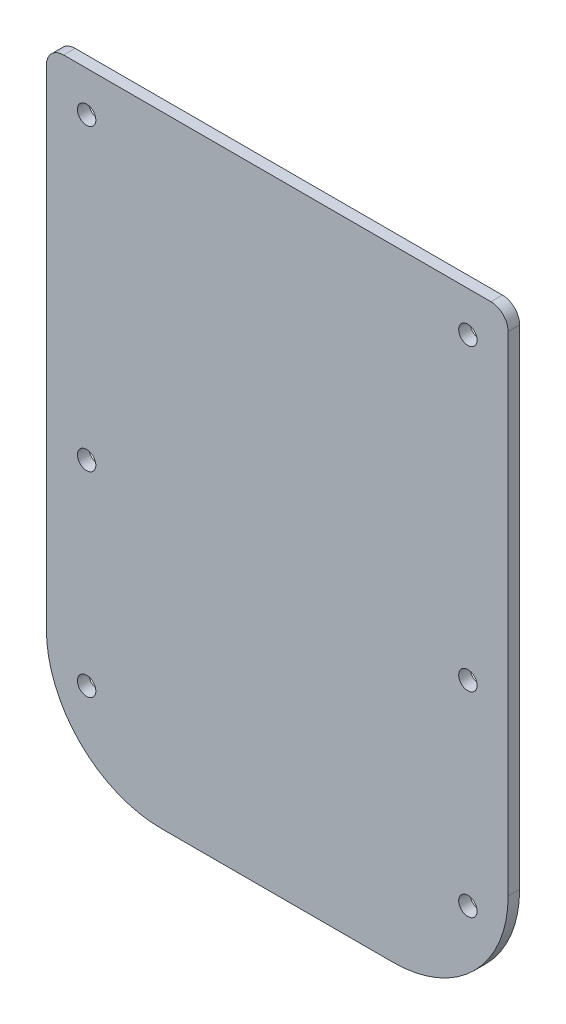
ISO-10303-21;
HEADER;
FILE_DESCRIPTION(('STEP AP214'),'2;1');
FILE_NAME('part.step','',(''),(''),'','','');
FILE_SCHEMA(('AUTOMOTIVE_DESIGN { 1 0 10303 214 1 1 1 1 }'));
ENDSEC;
DATA;
#1=APPLICATION_CONTEXT('core data for automotive mechanical design processes');
#2=APPLICATION_PROTOCOL_DEFINITION('international standard','automotive_design',2000,#1);
#3=PRODUCT_CONTEXT('',#1,'mechanical');
#4=PRODUCT('Part','Part','',(#3));
#5=PRODUCT_RELATED_PRODUCT_CATEGORY('part','',(#4));
#6=PRODUCT_DEFINITION_FORMATION('','',#4);
#7=PRODUCT_DEFINITION_CONTEXT('part definition',#1,'design');
#8=PRODUCT_DEFINITION('design','',#6,#7);
#9=PRODUCT_DEFINITION_SHAPE('','',#8);
#10=(LENGTH_UNIT() NAMED_UNIT(*) SI_UNIT(.MILLI.,.METRE.));
#11=(NAMED_UNIT(*) PLANE_ANGLE_UNIT() SI_UNIT($,.RADIAN.));
#12=(NAMED_UNIT(*) SI_UNIT($,.STERADIAN.) SOLID_ANGLE_UNIT());
#13=UNCERTAINTY_MEASURE_WITH_UNIT(LENGTH_MEASURE(1.E-05),#10,'distance_accuracy_value','');
#14=(GEOMETRIC_REPRESENTATION_CONTEXT(3) GLOBAL_UNCERTAINTY_ASSIGNED_CONTEXT((#13)) GLOBAL_UNIT_ASSIGNED_CONTEXT((#10,
#11,#12)) REPRESENTATION_CONTEXT('',''));
#15=CARTESIAN_POINT('',(0.,0.,0.));
#16=DIRECTION('',(0.,0.,1.));
#17=DIRECTION('',(1.,0.,0.));
#18=AXIS2_PLACEMENT_3D('',#15,#16,#17);
#19=CARTESIAN_POINT('',(0.,0.,2.));
#20=DIRECTION('',(1.,0.,0.));
#21=DIRECTION('',(0.,0.,-1.));
#22=AXIS2_PLACEMENT_3D('',#19,#20,#21);
#23=PLANE('',#22);
#24=DIRECTION('',(0.,-1.,0.));
#25=VECTOR('',#24,1.);
#26=CARTESIAN_POINT('',(0.,0.,0.));
#27=LINE('',#26,#25);
#28=CARTESIAN_POINT('',(0.,63.,0.));
#29=VERTEX_POINT('',#28);
#30=CARTESIAN_POINT('',(0.,-22.,0.));
#31=VERTEX_POINT('',#30);
#32=EDGE_CURVE('E129',#29,#31,#27,.T.);
#33=ORIENTED_EDGE('',*,*,#32,.T.);
#34=DIRECTION('',(0.,0.,-1.));
#35=VECTOR('',#34,1.);
#36=CARTESIAN_POINT('',(0.,-22.,2.));
#37=LINE('',#36,#35);
#38=CARTESIAN_POINT('',(0.,-22.,2.));
#39=VERTEX_POINT('',#38);
#40=EDGE_CURVE('E55',#31,#39,#37,.F.);
#41=ORIENTED_EDGE('',*,*,#40,.T.);
#42=DIRECTION('',(0.,-1.,0.));
#43=VECTOR('',#42,1.);
#44=CARTESIAN_POINT('',(0.,0.,2.));
#45=LINE('',#44,#43);
#46=CARTESIAN_POINT('',(0.,63.,2.));
#47=VERTEX_POINT('',#46);
#48=EDGE_CURVE('E124',#47,#39,#45,.T.);
#49=ORIENTED_EDGE('',*,*,#48,.F.);
#50=DIRECTION('',(0.,0.,-1.));
#51=VECTOR('',#50,1.);
#52=CARTESIAN_POINT('',(0.,63.,2.));
#53=LINE('',#52,#51);
#54=EDGE_CURVE('E140',#47,#29,#53,.T.);
#55=ORIENTED_EDGE('',*,*,#54,.T.);
#56=EDGE_LOOP('',(#33,#41,#49,#55));
#57=FACE_BOUND('',#56,.T.);
#58=ADVANCED_FACE('F32',(#57),#23,.F.);
#59=CARTESIAN_POINT('',(80.3,0.,2.));
#60=DIRECTION('',(-1.,0.,0.));
#61=DIRECTION('',(0.,0.,1.));
#62=AXIS2_PLACEMENT_3D('',#59,#60,#61);
#63=PLANE('',#62);
#64=DIRECTION('',(0.,1.,0.));
#65=VECTOR('',#64,1.);
#66=CARTESIAN_POINT('',(80.3,0.,2.));
#67=LINE('',#66,#65);
#68=CARTESIAN_POINT('',(80.3,-22.,2.));
#69=VERTEX_POINT('',#68);
#70=CARTESIAN_POINT('',(80.3,63.,2.));
#71=VERTEX_POINT('',#70);
#72=EDGE_CURVE('E127',#69,#71,#67,.T.);
#73=ORIENTED_EDGE('',*,*,#72,.F.);
#74=DIRECTION('',(0.,0.,1.));
#75=VECTOR('',#74,1.);
#76=CARTESIAN_POINT('',(80.3,-22.,0.));
#77=LINE('',#76,#75);
#78=CARTESIAN_POINT('',(80.3,-22.,0.));
#79=VERTEX_POINT('',#78);
#80=EDGE_CURVE('E11',#69,#79,#77,.F.);
#81=ORIENTED_EDGE('',*,*,#80,.T.);
#82=DIRECTION('',(0.,1.,0.));
#83=VECTOR('',#82,1.);
#84=CARTESIAN_POINT('',(80.3,0.,0.));
#85=LINE('',#84,#83);
#86=CARTESIAN_POINT('',(80.3,63.,0.));
#87=VERTEX_POINT('',#86);
#88=EDGE_CURVE('E125',#79,#87,#85,.T.);
#89=ORIENTED_EDGE('',*,*,#88,.T.);
#90=DIRECTION('',(0.,0.,-1.));
#91=VECTOR('',#90,1.);
#92=CARTESIAN_POINT('',(80.3,63.,2.));
#93=LINE('',#92,#91);
#94=EDGE_CURVE('E105',#87,#71,#93,.F.);
#95=ORIENTED_EDGE('',*,*,#94,.T.);
#96=EDGE_LOOP('',(#73,#81,#89,#95));
#97=FACE_BOUND('',#96,.T.);
#98=ADVANCED_FACE('F240',(#97),#63,.F.);
#99=CARTESIAN_POINT('',(0.,66.,2.));
#100=DIRECTION('',(0.,-1.,0.));
#101=DIRECTION('',(0.,0.,-1.));
#102=AXIS2_PLACEMENT_3D('',#99,#100,#101);
#103=PLANE('',#102);
#104=DIRECTION('',(-1.,0.,0.));
#105=VECTOR('',#104,1.);
#106=CARTESIAN_POINT('',(0.,66.,2.));
#107=LINE('',#106,#105);
#108=CARTESIAN_POINT('',(77.3,66.,2.));
#109=VERTEX_POINT('',#108);
#110=CARTESIAN_POINT('',(3.,66.,2.));
#111=VERTEX_POINT('',#110);
#112=EDGE_CURVE('E118',#109,#111,#107,.T.);
#113=ORIENTED_EDGE('',*,*,#112,.F.);
#114=DIRECTION('',(0.,0.,-1.));
#115=VECTOR('',#114,1.);
#116=CARTESIAN_POINT('',(77.3,66.,2.));
#117=LINE('',#116,#115);
#118=CARTESIAN_POINT('',(77.3,66.,0.));
#119=VERTEX_POINT('',#118);
#120=EDGE_CURVE('E103',#109,#119,#117,.T.);
#121=ORIENTED_EDGE('',*,*,#120,.T.);
#122=DIRECTION('',(-1.,0.,0.));
#123=VECTOR('',#122,1.);
#124=CARTESIAN_POINT('',(0.,66.,0.));
#125=LINE('',#124,#123);
#126=CARTESIAN_POINT('',(3.,66.,0.));
#127=VERTEX_POINT('',#126);
#128=EDGE_CURVE('E115',#119,#127,#125,.T.);
#129=ORIENTED_EDGE('',*,*,#128,.T.);
#130=DIRECTION('',(0.,0.,-1.));
#131=VECTOR('',#130,1.);
#132=CARTESIAN_POINT('',(3.,66.,2.));
#133=LINE('',#132,#131);
#134=EDGE_CURVE('E119',#127,#111,#133,.F.);
#135=ORIENTED_EDGE('',*,*,#134,.T.);
#136=EDGE_LOOP('',(#113,#121,#129,#135));
#137=FACE_BOUND('',#136,.T.);
#138=ADVANCED_FACE('F114',(#137),#103,.F.);
#139=CARTESIAN_POINT('',(0.,0.,2.));
#140=DIRECTION('',(0.,0.,-1.));
#141=DIRECTION('',(-1.,0.,0.));
#142=AXIS2_PLACEMENT_3D('',#139,#140,#141);
#143=PLANE('',#142);
#144=CARTESIAN_POINT('',(7.,-27.,2.));
#145=DIRECTION('',(0.,0.,1.));
#146=DIRECTION('',(1.,0.,0.));
#147=AXIS2_PLACEMENT_3D('',#144,#145,#146);
#148=CIRCLE('',#147,1.59999999999999);
#149=CARTESIAN_POINT('',(8.59999999999999,-27.,2.));
#150=VERTEX_POINT('',#149);
#151=EDGE_CURVE('E205',#150,#150,#148,.T.);
#152=ORIENTED_EDGE('',*,*,#151,.F.);
#153=EDGE_LOOP('',(#152));
#154=FACE_BOUND('',#153,.T.);
#155=CARTESIAN_POINT('',(73.3,-27.,2.));
#156=DIRECTION('',(0.,0.,1.));
#157=DIRECTION('',(1.,0.,0.));
#158=AXIS2_PLACEMENT_3D('',#155,#156,#157);
#159=CIRCLE('',#158,1.59999999999999);
#160=CARTESIAN_POINT('',(74.9,-27.,2.));
#161=VERTEX_POINT('',#160);
#162=EDGE_CURVE('E199',#161,#161,#159,.T.);
#163=ORIENTED_EDGE('',*,*,#162,.F.);
#164=EDGE_LOOP('',(#163));
#165=FACE_BOUND('',#164,.T.);
#166=CARTESIAN_POINT('',(7.,59.,2.));
#167=DIRECTION('',(0.,0.,1.));
#168=DIRECTION('',(1.,0.,0.));
#169=AXIS2_PLACEMENT_3D('',#166,#167,#168);
#170=CIRCLE('',#169,1.59999999999999);
#171=CARTESIAN_POINT('',(8.59999999999999,59.,2.));
#172=VERTEX_POINT('',#171);
#173=EDGE_CURVE('E164',#172,#172,#170,.T.);
#174=ORIENTED_EDGE('',*,*,#173,.F.);
#175=EDGE_LOOP('',(#174));
#176=FACE_BOUND('',#175,.T.);
#177=CARTESIAN_POINT('',(73.3,59.,2.));
#178=DIRECTION('',(0.,0.,1.));
#179=DIRECTION('',(1.,0.,0.));
#180=AXIS2_PLACEMENT_3D('',#177,#178,#179);
#181=CIRCLE('',#180,1.59999999999999);
#182=CARTESIAN_POINT('',(74.9,59.,2.));
#183=VERTEX_POINT('',#182);
#184=EDGE_CURVE('E187',#183,#183,#181,.T.);
#185=ORIENTED_EDGE('',*,*,#184,.F.);
#186=EDGE_LOOP('',(#185));
#187=FACE_BOUND('',#186,.T.);
#188=CARTESIAN_POINT('',(73.3,7.,2.));
#189=DIRECTION('',(0.,0.,1.));
#190=DIRECTION('',(1.,0.,0.));
#191=AXIS2_PLACEMENT_3D('',#188,#189,#190);
#192=CIRCLE('',#191,1.59999999999999);
#193=CARTESIAN_POINT('',(74.9,7.,2.));
#194=VERTEX_POINT('',#193);
#195=EDGE_CURVE('E181',#194,#194,#192,.T.);
#196=ORIENTED_EDGE('',*,*,#195,.F.);
#197=EDGE_LOOP('',(#196));
#198=FACE_BOUND('',#197,.T.);
#199=CARTESIAN_POINT('',(7.00000000000001,7.,2.));
#200=DIRECTION('',(0.,0.,1.));
#201=DIRECTION('',(1.,0.,0.));
#202=AXIS2_PLACEMENT_3D('',#199,#200,#201);
#203=CIRCLE('',#202,1.59999999999999);
#204=CARTESIAN_POINT('',(8.59999999999999,7.,2.));
#205=VERTEX_POINT('',#204);
#206=EDGE_CURVE('E171',#205,#205,#203,.T.);
#207=ORIENTED_EDGE('',*,*,#206,.F.);
#208=EDGE_LOOP('',(#207));
#209=FACE_BOUND('',#208,.T.);
#210=ORIENTED_EDGE('',*,*,#48,.T.);
#211=CARTESIAN_POINT('',(20.,-22.,2.));
#212=DIRECTION('',(0.,0.,-1.));
#213=DIRECTION('',(-1.,0.,0.));
#214=AXIS2_PLACEMENT_3D('',#211,#212,#213);
#215=CIRCLE('',#214,20.);
#216=CARTESIAN_POINT('',(20.,-42.,2.));
#217=VERTEX_POINT('',#216);
#218=EDGE_CURVE('E40',#39,#217,#215,.F.);
#219=ORIENTED_EDGE('',*,*,#218,.T.);
#220=DIRECTION('',(-1.,0.,0.));
#221=VECTOR('',#220,1.);
#222=CARTESIAN_POINT('',(80.3,-42.,2.));
#223=LINE('',#222,#221);
#224=CARTESIAN_POINT('',(60.3,-42.,2.));
#225=VERTEX_POINT('',#224);
#226=EDGE_CURVE('E157',#225,#217,#223,.T.);
#227=ORIENTED_EDGE('',*,*,#226,.F.);
#228=CARTESIAN_POINT('',(60.3,-22.,2.));
#229=DIRECTION('',(0.,0.,-1.));
#230=DIRECTION('',(-1.,0.,0.));
#231=AXIS2_PLACEMENT_3D('',#228,#229,#230);
#232=CIRCLE('',#231,20.);
#233=EDGE_CURVE('E47',#225,#69,#232,.F.);
#234=ORIENTED_EDGE('',*,*,#233,.T.);
#235=ORIENTED_EDGE('',*,*,#72,.T.);
#236=CARTESIAN_POINT('',(77.3,63.,2.));
#237=DIRECTION('',(0.,0.,-1.));
#238=DIRECTION('',(-1.,0.,0.));
#239=AXIS2_PLACEMENT_3D('',#236,#237,#238);
#240=CIRCLE('',#239,3.);
#241=EDGE_CURVE('E138',#71,#109,#240,.F.);
#242=ORIENTED_EDGE('',*,*,#241,.T.);
#243=ORIENTED_EDGE('',*,*,#112,.T.);
#244=CARTESIAN_POINT('',(3.,63.,2.));
#245=DIRECTION('',(0.,0.,-1.));
#246=DIRECTION('',(-1.,0.,0.));
#247=AXIS2_PLACEMENT_3D('',#244,#245,#246);
#248=CIRCLE('',#247,3.);
#249=EDGE_CURVE('E136',#111,#47,#248,.F.);
#250=ORIENTED_EDGE('',*,*,#249,.T.);
#251=EDGE_LOOP('',(#210,#219,#227,#234,#235,#242,#243,#250));
#252=FACE_BOUND('',#251,.T.);
#253=ADVANCED_FACE('F156',(#154,#165,#176,#187,#198,#209,#252),#143,.F.);
#254=CARTESIAN_POINT('',(0.,0.,0.));
#255=DIRECTION('',(0.,0.,-1.));
#256=DIRECTION('',(-1.,0.,0.));
#257=AXIS2_PLACEMENT_3D('',#254,#255,#256);
#258=PLANE('',#257);
#259=CARTESIAN_POINT('',(7.,-27.,0.));
#260=DIRECTION('',(0.,0.,-1.));
#261=DIRECTION('',(-1.,0.,0.));
#262=AXIS2_PLACEMENT_3D('',#259,#260,#261);
#263=CIRCLE('',#262,1.59999999999999);
#264=CARTESIAN_POINT('',(5.40000000000001,-27.,0.));
#265=VERTEX_POINT('',#264);
#266=EDGE_CURVE('E202',#265,#265,#263,.T.);
#267=ORIENTED_EDGE('',*,*,#266,.F.);
#268=EDGE_LOOP('',(#267));
#269=FACE_BOUND('',#268,.T.);
#270=CARTESIAN_POINT('',(73.3,-27.,0.));
#271=DIRECTION('',(0.,0.,-1.));
#272=DIRECTION('',(-1.,0.,0.));
#273=AXIS2_PLACEMENT_3D('',#270,#271,#272);
#274=CIRCLE('',#273,1.59999999999998);
#275=CARTESIAN_POINT('',(71.7,-27.,0.));
#276=VERTEX_POINT('',#275);
#277=EDGE_CURVE('E196',#276,#276,#274,.T.);
#278=ORIENTED_EDGE('',*,*,#277,.F.);
#279=EDGE_LOOP('',(#278));
#280=FACE_BOUND('',#279,.T.);
#281=CARTESIAN_POINT('',(7.,59.,0.));
#282=DIRECTION('',(0.,0.,1.));
#283=DIRECTION('',(1.,0.,0.));
#284=AXIS2_PLACEMENT_3D('',#281,#282,#283);
#285=CIRCLE('',#284,1.6);
#286=CARTESIAN_POINT('',(8.6,59.,0.));
#287=VERTEX_POINT('',#286);
#288=EDGE_CURVE('E190',#287,#287,#285,.T.);
#289=ORIENTED_EDGE('',*,*,#288,.T.);
#290=EDGE_LOOP('',(#289));
#291=FACE_BOUND('',#290,.T.);
#292=CARTESIAN_POINT('',(73.3,59.,0.));
#293=DIRECTION('',(0.,0.,1.));
#294=DIRECTION('',(1.,0.,0.));
#295=AXIS2_PLACEMENT_3D('',#292,#293,#294);
#296=CIRCLE('',#295,1.6);
#297=CARTESIAN_POINT('',(74.9,59.,0.));
#298=VERTEX_POINT('',#297);
#299=EDGE_CURVE('E184',#298,#298,#296,.T.);
#300=ORIENTED_EDGE('',*,*,#299,.T.);
#301=EDGE_LOOP('',(#300));
#302=FACE_BOUND('',#301,.T.);
#303=CARTESIAN_POINT('',(73.3,7.,0.));
#304=DIRECTION('',(0.,0.,1.));
#305=DIRECTION('',(1.,0.,0.));
#306=AXIS2_PLACEMENT_3D('',#303,#304,#305);
#307=CIRCLE('',#306,1.6);
#308=CARTESIAN_POINT('',(74.9,7.,0.));
#309=VERTEX_POINT('',#308);
#310=EDGE_CURVE('E178',#309,#309,#307,.T.);
#311=ORIENTED_EDGE('',*,*,#310,.T.);
#312=EDGE_LOOP('',(#311));
#313=FACE_BOUND('',#312,.T.);
#314=CARTESIAN_POINT('',(7.00000000000001,7.,0.));
#315=DIRECTION('',(0.,0.,1.));
#316=DIRECTION('',(1.,0.,0.));
#317=AXIS2_PLACEMENT_3D('',#314,#315,#316);
#318=CIRCLE('',#317,1.6);
#319=CARTESIAN_POINT('',(8.6,7.,0.));
#320=VERTEX_POINT('',#319);
#321=EDGE_CURVE('E169',#320,#320,#318,.T.);
#322=ORIENTED_EDGE('',*,*,#321,.T.);
#323=EDGE_LOOP('',(#322));
#324=FACE_BOUND('',#323,.T.);
#325=DIRECTION('',(1.,0.,0.));
#326=VECTOR('',#325,1.);
#327=CARTESIAN_POINT('',(0.,-42.,0.));
#328=LINE('',#327,#326);
#329=CARTESIAN_POINT('',(20.,-42.,0.));
#330=VERTEX_POINT('',#329);
#331=CARTESIAN_POINT('',(60.3,-42.,0.));
#332=VERTEX_POINT('',#331);
#333=EDGE_CURVE('E165',#330,#332,#328,.T.);
#334=ORIENTED_EDGE('',*,*,#333,.F.);
#335=CARTESIAN_POINT('',(20.,-22.,0.));
#336=DIRECTION('',(0.,0.,-1.));
#337=DIRECTION('',(-1.,0.,0.));
#338=AXIS2_PLACEMENT_3D('',#335,#336,#337);
#339=CIRCLE('',#338,20.);
#340=EDGE_CURVE('E151',#330,#31,#339,.T.);
#341=ORIENTED_EDGE('',*,*,#340,.T.);
#342=ORIENTED_EDGE('',*,*,#32,.F.);
#343=CARTESIAN_POINT('',(3.,63.,0.));
#344=DIRECTION('',(0.,0.,-1.));
#345=DIRECTION('',(-1.,0.,0.));
#346=AXIS2_PLACEMENT_3D('',#343,#344,#345);
#347=CIRCLE('',#346,3.);
#348=EDGE_CURVE('E109',#29,#127,#347,.T.);
#349=ORIENTED_EDGE('',*,*,#348,.T.);
#350=ORIENTED_EDGE('',*,*,#128,.F.);
#351=CARTESIAN_POINT('',(77.3,63.,0.));
#352=DIRECTION('',(0.,0.,-1.));
#353=DIRECTION('',(-1.,0.,0.));
#354=AXIS2_PLACEMENT_3D('',#351,#352,#353);
#355=CIRCLE('',#354,3.);
#356=EDGE_CURVE('E99',#119,#87,#355,.T.);
#357=ORIENTED_EDGE('',*,*,#356,.T.);
#358=ORIENTED_EDGE('',*,*,#88,.F.);
#359=CARTESIAN_POINT('',(60.3,-22.,0.));
#360=DIRECTION('',(0.,0.,-1.));
#361=DIRECTION('',(-1.,0.,0.));
#362=AXIS2_PLACEMENT_3D('',#359,#360,#361);
#363=CIRCLE('',#362,20.);
#364=EDGE_CURVE('E149',#79,#332,#363,.T.);
#365=ORIENTED_EDGE('',*,*,#364,.T.);
#366=EDGE_LOOP('',(#334,#341,#342,#349,#350,#357,#358,#365));
#367=FACE_BOUND('',#366,.T.);
#368=ADVANCED_FACE('F122',(#269,#280,#291,#302,#313,#324,#367),#258,.T.);
#369=CARTESIAN_POINT('',(7.00000000000001,7.,2.));
#370=DIRECTION('',(0.,0.,1.));
#371=DIRECTION('',(1.,0.,0.));
#372=AXIS2_PLACEMENT_3D('',#369,#370,#371);
#373=CYLINDRICAL_SURFACE('',#372,1.59999999999999);
#374=ORIENTED_EDGE('',*,*,#321,.F.);
#375=EDGE_LOOP('',(#374));
#376=FACE_BOUND('',#375,.T.);
#377=ORIENTED_EDGE('',*,*,#206,.T.);
#378=EDGE_LOOP('',(#377));
#379=FACE_BOUND('',#378,.T.);
#380=ADVANCED_FACE('F224',(#376,#379),#373,.F.);
#381=CARTESIAN_POINT('',(73.3,7.,2.));
#382=DIRECTION('',(0.,0.,1.));
#383=DIRECTION('',(1.,0.,0.));
#384=AXIS2_PLACEMENT_3D('',#381,#382,#383);
#385=CYLINDRICAL_SURFACE('',#384,1.6);
#386=ORIENTED_EDGE('',*,*,#310,.F.);
#387=EDGE_LOOP('',(#386));
#388=FACE_BOUND('',#387,.T.);
#389=ORIENTED_EDGE('',*,*,#195,.T.);
#390=EDGE_LOOP('',(#389));
#391=FACE_BOUND('',#390,.T.);
#392=ADVANCED_FACE('F226',(#388,#391),#385,.F.);
#393=CARTESIAN_POINT('',(73.3,59.,2.));
#394=DIRECTION('',(0.,0.,1.));
#395=DIRECTION('',(1.,0.,0.));
#396=AXIS2_PLACEMENT_3D('',#393,#394,#395);
#397=CYLINDRICAL_SURFACE('',#396,1.6);
#398=ORIENTED_EDGE('',*,*,#299,.F.);
#399=EDGE_LOOP('',(#398));
#400=FACE_BOUND('',#399,.T.);
#401=ORIENTED_EDGE('',*,*,#184,.T.);
#402=EDGE_LOOP('',(#401));
#403=FACE_BOUND('',#402,.T.);
#404=ADVANCED_FACE('F233',(#400,#403),#397,.F.);
#405=CARTESIAN_POINT('',(7.,59.,2.));
#406=DIRECTION('',(0.,0.,1.));
#407=DIRECTION('',(1.,0.,0.));
#408=AXIS2_PLACEMENT_3D('',#405,#406,#407);
#409=CYLINDRICAL_SURFACE('',#408,1.59999999999999);
#410=ORIENTED_EDGE('',*,*,#288,.F.);
#411=EDGE_LOOP('',(#410));
#412=FACE_BOUND('',#411,.T.);
#413=ORIENTED_EDGE('',*,*,#173,.T.);
#414=EDGE_LOOP('',(#413));
#415=FACE_BOUND('',#414,.T.);
#416=ADVANCED_FACE('F252',(#412,#415),#409,.F.);
#417=CARTESIAN_POINT('',(77.3,63.,2.));
#418=DIRECTION('',(0.,0.,-1.));
#419=DIRECTION('',(-1.,0.,0.));
#420=AXIS2_PLACEMENT_3D('',#417,#418,#419);
#421=CYLINDRICAL_SURFACE('',#420,3.);
#422=ORIENTED_EDGE('',*,*,#241,.F.);
#423=ORIENTED_EDGE('',*,*,#94,.F.);
#424=ORIENTED_EDGE('',*,*,#356,.F.);
#425=ORIENTED_EDGE('',*,*,#120,.F.);
#426=EDGE_LOOP('',(#422,#423,#424,#425));
#427=FACE_BOUND('',#426,.T.);
#428=ADVANCED_FACE('F102',(#427),#421,.T.);
#429=CARTESIAN_POINT('',(3.,63.,2.));
#430=DIRECTION('',(0.,0.,-1.));
#431=DIRECTION('',(-1.,0.,0.));
#432=AXIS2_PLACEMENT_3D('',#429,#430,#431);
#433=CYLINDRICAL_SURFACE('',#432,3.);
#434=ORIENTED_EDGE('',*,*,#249,.F.);
#435=ORIENTED_EDGE('',*,*,#134,.F.);
#436=ORIENTED_EDGE('',*,*,#348,.F.);
#437=ORIENTED_EDGE('',*,*,#54,.F.);
#438=EDGE_LOOP('',(#434,#435,#436,#437));
#439=FACE_BOUND('',#438,.T.);
#440=ADVANCED_FACE('F251',(#439),#433,.T.);
#441=CARTESIAN_POINT('',(0.,-42.,0.));
#442=DIRECTION('',(0.,-1.,0.));
#443=DIRECTION('',(0.,0.,-1.));
#444=AXIS2_PLACEMENT_3D('',#441,#442,#443);
#445=PLANE('',#444);
#446=ORIENTED_EDGE('',*,*,#226,.T.);
#447=DIRECTION('',(0.,0.,-1.));
#448=VECTOR('',#447,1.);
#449=CARTESIAN_POINT('',(20.,-42.,0.));
#450=LINE('',#449,#448);
#451=EDGE_CURVE('E146',#217,#330,#450,.T.);
#452=ORIENTED_EDGE('',*,*,#451,.T.);
#453=ORIENTED_EDGE('',*,*,#333,.T.);
#454=DIRECTION('',(0.,0.,1.));
#455=VECTOR('',#454,1.);
#456=CARTESIAN_POINT('',(60.3,-42.,2.));
#457=LINE('',#456,#455);
#458=EDGE_CURVE('E143',#332,#225,#457,.T.);
#459=ORIENTED_EDGE('',*,*,#458,.T.);
#460=EDGE_LOOP('',(#446,#452,#453,#459));
#461=FACE_BOUND('',#460,.T.);
#462=ADVANCED_FACE('F161',(#461),#445,.T.);
#463=CARTESIAN_POINT('',(20.,-22.,0.));
#464=DIRECTION('',(0.,0.,1.));
#465=DIRECTION('',(1.,0.,0.));
#466=AXIS2_PLACEMENT_3D('',#463,#464,#465);
#467=CYLINDRICAL_SURFACE('',#466,20.);
#468=ORIENTED_EDGE('',*,*,#218,.F.);
#469=ORIENTED_EDGE('',*,*,#40,.F.);
#470=ORIENTED_EDGE('',*,*,#340,.F.);
#471=ORIENTED_EDGE('',*,*,#451,.F.);
#472=EDGE_LOOP('',(#468,#469,#470,#471));
#473=FACE_BOUND('',#472,.T.);
#474=ADVANCED_FACE('F167',(#473),#467,.T.);
#475=CARTESIAN_POINT('',(60.3,-22.,0.));
#476=DIRECTION('',(0.,0.,-1.));
#477=DIRECTION('',(-1.,0.,0.));
#478=AXIS2_PLACEMENT_3D('',#475,#476,#477);
#479=CYLINDRICAL_SURFACE('',#478,20.);
#480=ORIENTED_EDGE('',*,*,#364,.F.);
#481=ORIENTED_EDGE('',*,*,#80,.F.);
#482=ORIENTED_EDGE('',*,*,#233,.F.);
#483=ORIENTED_EDGE('',*,*,#458,.F.);
#484=EDGE_LOOP('',(#480,#481,#482,#483));
#485=FACE_BOUND('',#484,.T.);
#486=ADVANCED_FACE('F34',(#485),#479,.T.);
#487=CARTESIAN_POINT('',(73.3,-27.,2.));
#488=DIRECTION('',(0.,0.,1.));
#489=DIRECTION('',(1.,0.,0.));
#490=AXIS2_PLACEMENT_3D('',#487,#488,#489);
#491=CYLINDRICAL_SURFACE('',#490,1.59999999999998);
#492=ORIENTED_EDGE('',*,*,#277,.T.);
#493=EDGE_LOOP('',(#492));
#494=FACE_BOUND('',#493,.T.);
#495=ORIENTED_EDGE('',*,*,#162,.T.);
#496=EDGE_LOOP('',(#495));
#497=FACE_BOUND('',#496,.T.);
#498=ADVANCED_FACE('F260',(#494,#497),#491,.F.);
#499=CARTESIAN_POINT('',(7.,-27.,2.));
#500=DIRECTION('',(0.,0.,1.));
#501=DIRECTION('',(1.,0.,0.));
#502=AXIS2_PLACEMENT_3D('',#499,#500,#501);
#503=CYLINDRICAL_SURFACE('',#502,1.59999999999999);
#504=ORIENTED_EDGE('',*,*,#266,.T.);
#505=EDGE_LOOP('',(#504));
#506=FACE_BOUND('',#505,.T.);
#507=ORIENTED_EDGE('',*,*,#151,.T.);
#508=EDGE_LOOP('',(#507));
#509=FACE_BOUND('',#508,.T.);
#510=ADVANCED_FACE('F209',(#506,#509),#503,.F.);
#511=CLOSED_SHELL('',(#58,#98,#138,#253,#368,#380,#392,#404,#416,#428,#440,#462,#474,#486,#498,#510));
#512=MANIFOLD_SOLID_BREP('B2',#511);
#513=ADVANCED_BREP_SHAPE_REPRESENTATION('',(#18,#512),#14);
#514=SHAPE_DEFINITION_REPRESENTATION(#9,#513);
ENDSEC;
END-ISO-10303-21;
